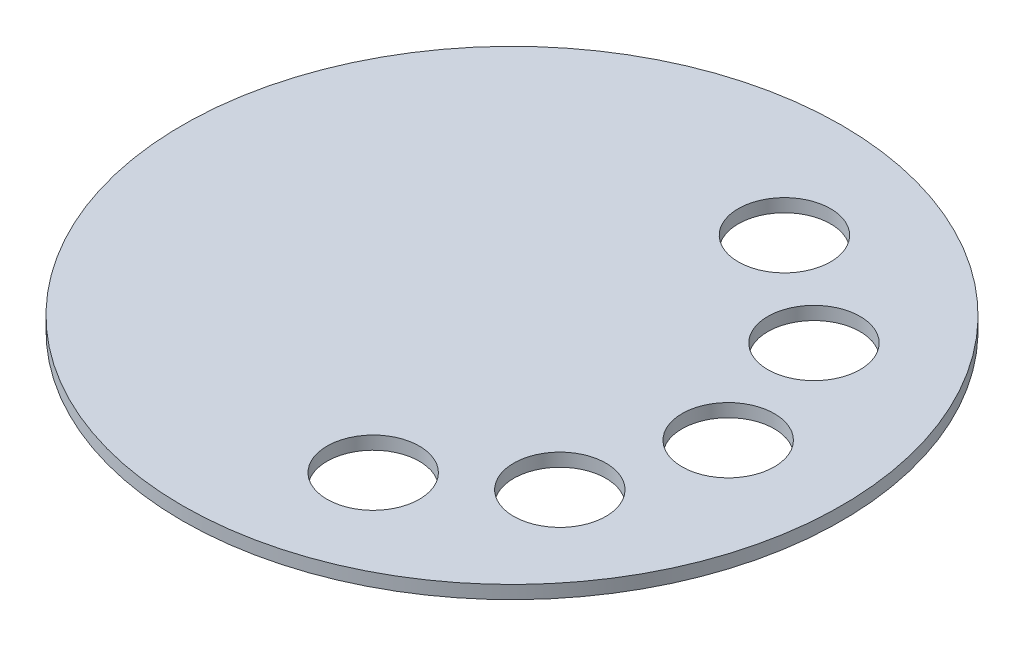
ISO-10303-21;
HEADER;
FILE_DESCRIPTION(('STEP AP214'),'2;1');
FILE_NAME('part.step','',(''),(''),'','','');
FILE_SCHEMA(('AUTOMOTIVE_DESIGN { 1 0 10303 214 1 1 1 1 }'));
ENDSEC;
DATA;
#1=APPLICATION_CONTEXT('core data for automotive mechanical design processes');
#2=APPLICATION_PROTOCOL_DEFINITION('international standard','automotive_design',2000,#1);
#3=PRODUCT_CONTEXT('',#1,'mechanical');
#4=PRODUCT('Part','Part','',(#3));
#5=PRODUCT_RELATED_PRODUCT_CATEGORY('part','',(#4));
#6=PRODUCT_DEFINITION_FORMATION('','',#4);
#7=PRODUCT_DEFINITION_CONTEXT('part definition',#1,'design');
#8=PRODUCT_DEFINITION('design','',#6,#7);
#9=PRODUCT_DEFINITION_SHAPE('','',#8);
#10=(LENGTH_UNIT() NAMED_UNIT(*) SI_UNIT(.MILLI.,.METRE.));
#11=(NAMED_UNIT(*) PLANE_ANGLE_UNIT() SI_UNIT($,.RADIAN.));
#12=(NAMED_UNIT(*) SI_UNIT($,.STERADIAN.) SOLID_ANGLE_UNIT());
#13=UNCERTAINTY_MEASURE_WITH_UNIT(LENGTH_MEASURE(1.E-05),#10,'distance_accuracy_value','');
#14=(GEOMETRIC_REPRESENTATION_CONTEXT(3) GLOBAL_UNCERTAINTY_ASSIGNED_CONTEXT((#13)) GLOBAL_UNIT_ASSIGNED_CONTEXT((#10,
#11,#12)) REPRESENTATION_CONTEXT('',''));
#15=CARTESIAN_POINT('',(0.,0.,0.));
#16=DIRECTION('',(0.,0.,1.));
#17=DIRECTION('',(1.,0.,0.));
#18=AXIS2_PLACEMENT_3D('',#15,#16,#17);
#19=CARTESIAN_POINT('',(0.,5.,0.));
#20=DIRECTION('',(0.,-1.,0.));
#21=DIRECTION('',(0.,0.,-1.));
#22=AXIS2_PLACEMENT_3D('',#19,#20,#21);
#23=CYLINDRICAL_SURFACE('',#22,125.);
#24=CARTESIAN_POINT('',(0.,5.,0.));
#25=DIRECTION('',(0.,1.,0.));
#26=DIRECTION('',(0.,0.,1.));
#27=AXIS2_PLACEMENT_3D('',#24,#25,#26);
#28=CIRCLE('',#27,125.);
#29=CARTESIAN_POINT('',(0.,5.,125.));
#30=VERTEX_POINT('',#29);
#31=EDGE_CURVE('E10',#30,#30,#28,.T.);
#32=ORIENTED_EDGE('',*,*,#31,.F.);
#33=EDGE_LOOP('',(#32));
#34=FACE_BOUND('',#33,.T.);
#35=CARTESIAN_POINT('',(0.,0.,0.));
#36=DIRECTION('',(0.,1.,0.));
#37=DIRECTION('',(0.,0.,1.));
#38=AXIS2_PLACEMENT_3D('',#35,#36,#37);
#39=CIRCLE('',#38,125.);
#40=CARTESIAN_POINT('',(0.,0.,125.));
#41=VERTEX_POINT('',#40);
#42=EDGE_CURVE('E34',#41,#41,#39,.T.);
#43=ORIENTED_EDGE('',*,*,#42,.T.);
#44=EDGE_LOOP('',(#43));
#45=FACE_BOUND('',#44,.T.);
#46=ADVANCED_FACE('F31',(#34,#45),#23,.T.);
#47=CARTESIAN_POINT('',(0.,5.,0.));
#48=DIRECTION('',(0.,1.,0.));
#49=DIRECTION('',(0.,0.,1.));
#50=AXIS2_PLACEMENT_3D('',#47,#48,#49);
#51=PLANE('',#50);
#52=CARTESIAN_POINT('',(66.3393935387454,5.,-48.1983906879831));
#53=DIRECTION('',(0.,1.,0.));
#54=DIRECTION('',(0.,0.,1.));
#55=AXIS2_PLACEMENT_3D('',#52,#53,#54);
#56=CIRCLE('',#55,17.5);
#57=CARTESIAN_POINT('',(66.3393935387454,5.,-30.6983906879831));
#58=VERTEX_POINT('',#57);
#59=EDGE_CURVE('E41',#58,#58,#56,.F.);
#60=ORIENTED_EDGE('',*,*,#59,.T.);
#61=EDGE_LOOP('',(#60));
#62=FACE_BOUND('',#61,.T.);
#63=CARTESIAN_POINT('',(82.,5.,0.));
#64=DIRECTION('',(0.,1.,0.));
#65=DIRECTION('',(0.,0.,1.));
#66=AXIS2_PLACEMENT_3D('',#63,#64,#65);
#67=CIRCLE('',#66,17.5);
#68=CARTESIAN_POINT('',(82.,5.,17.5));
#69=VERTEX_POINT('',#68);
#70=EDGE_CURVE('E45',#69,#69,#67,.F.);
#71=ORIENTED_EDGE('',*,*,#70,.T.);
#72=EDGE_LOOP('',(#71));
#73=FACE_BOUND('',#72,.T.);
#74=CARTESIAN_POINT('',(66.3393935387459,5.,48.1983906879826));
#75=DIRECTION('',(0.,1.,0.));
#76=DIRECTION('',(0.,0.,1.));
#77=AXIS2_PLACEMENT_3D('',#74,#75,#76);
#78=CIRCLE('',#77,17.5);
#79=CARTESIAN_POINT('',(66.3393935387459,5.,65.6983906879826));
#80=VERTEX_POINT('',#79);
#81=EDGE_CURVE('E48',#80,#80,#78,.F.);
#82=ORIENTED_EDGE('',*,*,#81,.T.);
#83=EDGE_LOOP('',(#82));
#84=FACE_BOUND('',#83,.T.);
#85=CARTESIAN_POINT('',(25.3393935387458,5.,77.9866343362026));
#86=DIRECTION('',(0.,1.,0.));
#87=DIRECTION('',(0.,0.,1.));
#88=AXIS2_PLACEMENT_3D('',#85,#86,#87);
#89=CIRCLE('',#88,17.5);
#90=CARTESIAN_POINT('',(25.3393935387458,5.,95.4866343362026));
#91=VERTEX_POINT('',#90);
#92=EDGE_CURVE('E51',#91,#91,#89,.F.);
#93=ORIENTED_EDGE('',*,*,#92,.T.);
#94=EDGE_LOOP('',(#93));
#95=FACE_BOUND('',#94,.T.);
#96=CARTESIAN_POINT('',(25.3393935387452,5.,-77.9866343362028));
#97=DIRECTION('',(0.,1.,0.));
#98=DIRECTION('',(0.,0.,1.));
#99=AXIS2_PLACEMENT_3D('',#96,#97,#98);
#100=CIRCLE('',#99,17.5);
#101=CARTESIAN_POINT('',(25.3393935387452,5.,-60.4866343362028));
#102=VERTEX_POINT('',#101);
#103=EDGE_CURVE('E54',#102,#102,#100,.F.);
#104=ORIENTED_EDGE('',*,*,#103,.T.);
#105=EDGE_LOOP('',(#104));
#106=FACE_BOUND('',#105,.T.);
#107=ORIENTED_EDGE('',*,*,#31,.T.);
#108=EDGE_LOOP('',(#107));
#109=FACE_BOUND('',#108,.T.);
#110=ADVANCED_FACE('F93',(#62,#73,#84,#95,#106,#109),#51,.T.);
#111=CARTESIAN_POINT('',(0.,0.,0.));
#112=DIRECTION('',(0.,1.,0.));
#113=DIRECTION('',(0.,0.,1.));
#114=AXIS2_PLACEMENT_3D('',#111,#112,#113);
#115=PLANE('',#114);
#116=CARTESIAN_POINT('',(66.3393935387454,0.,-48.1983906879831));
#117=DIRECTION('',(0.,1.,0.));
#118=DIRECTION('',(0.,0.,1.));
#119=AXIS2_PLACEMENT_3D('',#116,#117,#118);
#120=CIRCLE('',#119,17.5);
#121=CARTESIAN_POINT('',(66.3393935387454,0.,-30.6983906879831));
#122=VERTEX_POINT('',#121);
#123=EDGE_CURVE('E61',#122,#122,#120,.T.);
#124=ORIENTED_EDGE('',*,*,#123,.T.);
#125=EDGE_LOOP('',(#124));
#126=FACE_BOUND('',#125,.T.);
#127=CARTESIAN_POINT('',(82.,0.,0.));
#128=DIRECTION('',(0.,1.,0.));
#129=DIRECTION('',(0.,0.,1.));
#130=AXIS2_PLACEMENT_3D('',#127,#128,#129);
#131=CIRCLE('',#130,17.5);
#132=CARTESIAN_POINT('',(82.,0.,17.5));
#133=VERTEX_POINT('',#132);
#134=EDGE_CURVE('E64',#133,#133,#131,.T.);
#135=ORIENTED_EDGE('',*,*,#134,.T.);
#136=EDGE_LOOP('',(#135));
#137=FACE_BOUND('',#136,.T.);
#138=CARTESIAN_POINT('',(66.3393935387459,0.,48.1983906879826));
#139=DIRECTION('',(0.,1.,0.));
#140=DIRECTION('',(0.,0.,1.));
#141=AXIS2_PLACEMENT_3D('',#138,#139,#140);
#142=CIRCLE('',#141,17.5);
#143=CARTESIAN_POINT('',(66.3393935387459,0.,65.6983906879826));
#144=VERTEX_POINT('',#143);
#145=EDGE_CURVE('E67',#144,#144,#142,.T.);
#146=ORIENTED_EDGE('',*,*,#145,.T.);
#147=EDGE_LOOP('',(#146));
#148=FACE_BOUND('',#147,.T.);
#149=CARTESIAN_POINT('',(25.3393935387458,0.,77.9866343362026));
#150=DIRECTION('',(0.,1.,0.));
#151=DIRECTION('',(0.,0.,1.));
#152=AXIS2_PLACEMENT_3D('',#149,#150,#151);
#153=CIRCLE('',#152,17.5);
#154=CARTESIAN_POINT('',(25.3393935387458,0.,95.4866343362026));
#155=VERTEX_POINT('',#154);
#156=EDGE_CURVE('E60',#155,#155,#153,.T.);
#157=ORIENTED_EDGE('',*,*,#156,.T.);
#158=EDGE_LOOP('',(#157));
#159=FACE_BOUND('',#158,.T.);
#160=CARTESIAN_POINT('',(25.3393935387452,0.,-77.9866343362028));
#161=DIRECTION('',(0.,1.,0.));
#162=DIRECTION('',(0.,0.,1.));
#163=AXIS2_PLACEMENT_3D('',#160,#161,#162);
#164=CIRCLE('',#163,17.5);
#165=CARTESIAN_POINT('',(25.3393935387452,0.,-60.4866343362028));
#166=VERTEX_POINT('',#165);
#167=EDGE_CURVE('E57',#166,#166,#164,.T.);
#168=ORIENTED_EDGE('',*,*,#167,.T.);
#169=EDGE_LOOP('',(#168));
#170=FACE_BOUND('',#169,.T.);
#171=ORIENTED_EDGE('',*,*,#42,.F.);
#172=EDGE_LOOP('',(#171));
#173=FACE_BOUND('',#172,.T.);
#174=ADVANCED_FACE('F73',(#126,#137,#148,#159,#170,#173),#115,.F.);
#175=CARTESIAN_POINT('',(25.3393935387452,10.,-77.9866343362028));
#176=DIRECTION('',(0.,-1.,0.));
#177=DIRECTION('',(0.,0.,-1.));
#178=AXIS2_PLACEMENT_3D('',#175,#176,#177);
#179=CYLINDRICAL_SURFACE('',#178,17.5);
#180=ORIENTED_EDGE('',*,*,#103,.F.);
#181=EDGE_LOOP('',(#180));
#182=FACE_BOUND('',#181,.T.);
#183=ORIENTED_EDGE('',*,*,#167,.F.);
#184=EDGE_LOOP('',(#183));
#185=FACE_BOUND('',#184,.T.);
#186=ADVANCED_FACE('F79',(#182,#185),#179,.F.);
#187=CARTESIAN_POINT('',(25.3393935387458,10.,77.9866343362026));
#188=DIRECTION('',(0.,-1.,0.));
#189=DIRECTION('',(0.,0.,-1.));
#190=AXIS2_PLACEMENT_3D('',#187,#188,#189);
#191=CYLINDRICAL_SURFACE('',#190,17.5);
#192=ORIENTED_EDGE('',*,*,#92,.F.);
#193=EDGE_LOOP('',(#192));
#194=FACE_BOUND('',#193,.T.);
#195=ORIENTED_EDGE('',*,*,#156,.F.);
#196=EDGE_LOOP('',(#195));
#197=FACE_BOUND('',#196,.T.);
#198=ADVANCED_FACE('F76',(#194,#197),#191,.F.);
#199=CARTESIAN_POINT('',(66.3393935387459,10.,48.1983906879826));
#200=DIRECTION('',(0.,-1.,0.));
#201=DIRECTION('',(0.,0.,-1.));
#202=AXIS2_PLACEMENT_3D('',#199,#200,#201);
#203=CYLINDRICAL_SURFACE('',#202,17.5);
#204=ORIENTED_EDGE('',*,*,#81,.F.);
#205=EDGE_LOOP('',(#204));
#206=FACE_BOUND('',#205,.T.);
#207=ORIENTED_EDGE('',*,*,#145,.F.);
#208=EDGE_LOOP('',(#207));
#209=FACE_BOUND('',#208,.T.);
#210=ADVANCED_FACE('F78',(#206,#209),#203,.F.);
#211=CARTESIAN_POINT('',(82.,10.,0.));
#212=DIRECTION('',(0.,-1.,0.));
#213=DIRECTION('',(0.,0.,-1.));
#214=AXIS2_PLACEMENT_3D('',#211,#212,#213);
#215=CYLINDRICAL_SURFACE('',#214,17.5);
#216=ORIENTED_EDGE('',*,*,#70,.F.);
#217=EDGE_LOOP('',(#216));
#218=FACE_BOUND('',#217,.T.);
#219=ORIENTED_EDGE('',*,*,#134,.F.);
#220=EDGE_LOOP('',(#219));
#221=FACE_BOUND('',#220,.T.);
#222=ADVANCED_FACE('F86',(#218,#221),#215,.F.);
#223=CARTESIAN_POINT('',(66.3393935387454,10.,-48.1983906879831));
#224=DIRECTION('',(0.,-1.,0.));
#225=DIRECTION('',(0.,0.,-1.));
#226=AXIS2_PLACEMENT_3D('',#223,#224,#225);
#227=CYLINDRICAL_SURFACE('',#226,17.5);
#228=ORIENTED_EDGE('',*,*,#59,.F.);
#229=EDGE_LOOP('',(#228));
#230=FACE_BOUND('',#229,.T.);
#231=ORIENTED_EDGE('',*,*,#123,.F.);
#232=EDGE_LOOP('',(#231));
#233=FACE_BOUND('',#232,.T.);
#234=ADVANCED_FACE('F109',(#230,#233),#227,.F.);
#235=CLOSED_SHELL('',(#46,#110,#174,#186,#198,#210,#222,#234));
#236=MANIFOLD_SOLID_BREP('B2',#235);
#237=ADVANCED_BREP_SHAPE_REPRESENTATION('',(#18,#236),#14);
#238=SHAPE_DEFINITION_REPRESENTATION(#9,#237);
ENDSEC;
END-ISO-10303-21;
